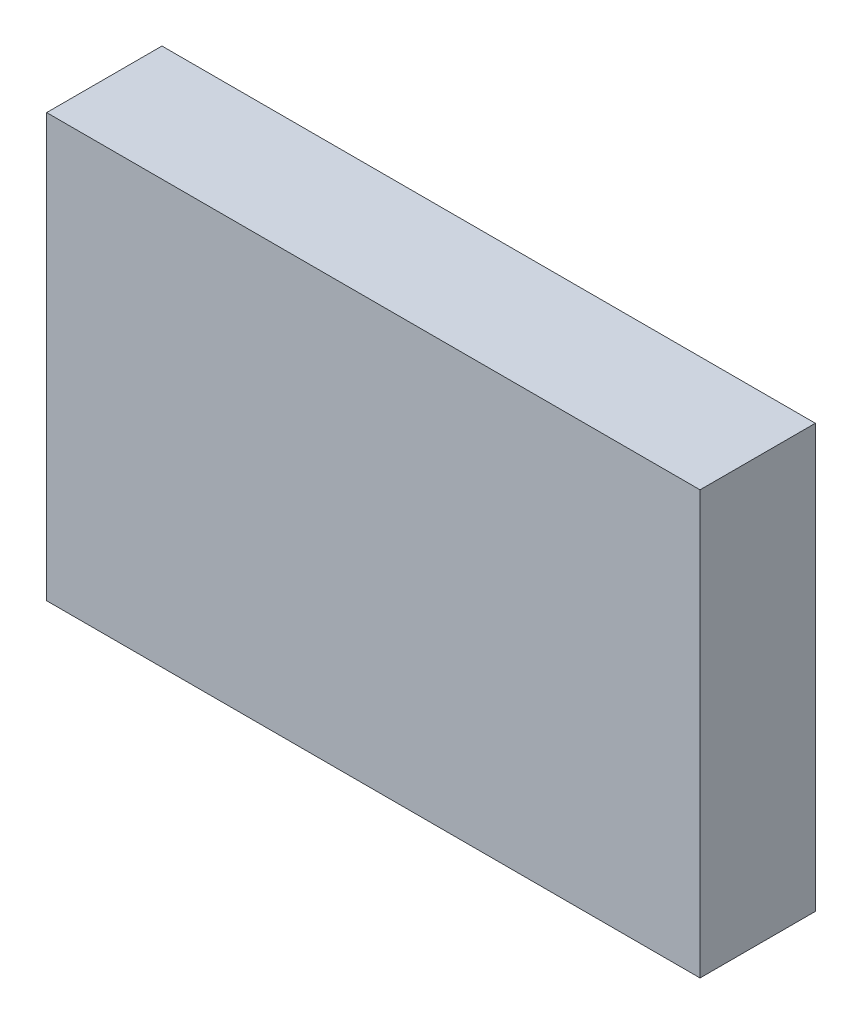
ISO-10303-21;
HEADER;
FILE_DESCRIPTION(('STEP AP214'),'2;1');
FILE_NAME('part.step','',(''),(''),'','','');
FILE_SCHEMA(('AUTOMOTIVE_DESIGN { 1 0 10303 214 1 1 1 1 }'));
ENDSEC;
DATA;
#1=APPLICATION_CONTEXT('core data for automotive mechanical design processes');
#2=APPLICATION_PROTOCOL_DEFINITION('international standard','automotive_design',2000,#1);
#3=PRODUCT_CONTEXT('',#1,'mechanical');
#4=PRODUCT('Part','Part','',(#3));
#5=PRODUCT_RELATED_PRODUCT_CATEGORY('part','',(#4));
#6=PRODUCT_DEFINITION_FORMATION('','',#4);
#7=PRODUCT_DEFINITION_CONTEXT('part definition',#1,'design');
#8=PRODUCT_DEFINITION('design','',#6,#7);
#9=PRODUCT_DEFINITION_SHAPE('','',#8);
#10=(LENGTH_UNIT() NAMED_UNIT(*) SI_UNIT(.MILLI.,.METRE.));
#11=(NAMED_UNIT(*) PLANE_ANGLE_UNIT() SI_UNIT($,.RADIAN.));
#12=(NAMED_UNIT(*) SI_UNIT($,.STERADIAN.) SOLID_ANGLE_UNIT());
#13=UNCERTAINTY_MEASURE_WITH_UNIT(LENGTH_MEASURE(1.E-05),#10,'distance_accuracy_value','');
#14=(GEOMETRIC_REPRESENTATION_CONTEXT(3) GLOBAL_UNCERTAINTY_ASSIGNED_CONTEXT((#13)) GLOBAL_UNIT_ASSIGNED_CONTEXT((#10,
#11,#12)) REPRESENTATION_CONTEXT('',''));
#15=CARTESIAN_POINT('',(0.,0.,0.));
#16=DIRECTION('',(0.,0.,1.));
#17=DIRECTION('',(1.,0.,0.));
#18=AXIS2_PLACEMENT_3D('',#15,#16,#17);
#19=CARTESIAN_POINT('',(-42.5,-27.5,15.));
#20=DIRECTION('',(0.,1.,0.));
#21=DIRECTION('',(0.,0.,1.));
#22=AXIS2_PLACEMENT_3D('',#19,#20,#21);
#23=PLANE('',#22);
#24=DIRECTION('',(1.,0.,0.));
#25=VECTOR('',#24,1.);
#26=CARTESIAN_POINT('',(-42.5,-27.5,0.));
#27=LINE('',#26,#25);
#28=CARTESIAN_POINT('',(-42.5,-27.5,0.));
#29=VERTEX_POINT('',#28);
#30=CARTESIAN_POINT('',(42.5,-27.5,0.));
#31=VERTEX_POINT('',#30);
#32=EDGE_CURVE('E107',#29,#31,#27,.T.);
#33=ORIENTED_EDGE('',*,*,#32,.T.);
#34=DIRECTION('',(0.,0.,-1.));
#35=VECTOR('',#34,1.);
#36=CARTESIAN_POINT('',(42.5,-27.5,15.));
#37=LINE('',#36,#35);
#38=CARTESIAN_POINT('',(42.5,-27.5,15.));
#39=VERTEX_POINT('',#38);
#40=EDGE_CURVE('E11',#39,#31,#37,.T.);
#41=ORIENTED_EDGE('',*,*,#40,.F.);
#42=DIRECTION('',(1.,0.,0.));
#43=VECTOR('',#42,1.);
#44=CARTESIAN_POINT('',(-42.5,-27.5,15.));
#45=LINE('',#44,#43);
#46=CARTESIAN_POINT('',(-42.5,-27.5,15.));
#47=VERTEX_POINT('',#46);
#48=EDGE_CURVE('E89',#47,#39,#45,.T.);
#49=ORIENTED_EDGE('',*,*,#48,.F.);
#50=DIRECTION('',(0.,0.,-1.));
#51=VECTOR('',#50,1.);
#52=CARTESIAN_POINT('',(-42.5,-27.5,15.));
#53=LINE('',#52,#51);
#54=EDGE_CURVE('E56',#47,#29,#53,.T.);
#55=ORIENTED_EDGE('',*,*,#54,.T.);
#56=EDGE_LOOP('',(#33,#41,#49,#55));
#57=FACE_BOUND('',#56,.T.);
#58=ADVANCED_FACE('F39',(#57),#23,.F.);
#59=CARTESIAN_POINT('',(42.5,-27.5,15.));
#60=DIRECTION('',(-1.,0.,0.));
#61=DIRECTION('',(0.,0.,1.));
#62=AXIS2_PLACEMENT_3D('',#59,#60,#61);
#63=PLANE('',#62);
#64=DIRECTION('',(0.,1.,0.));
#65=VECTOR('',#64,1.);
#66=CARTESIAN_POINT('',(42.5,-27.5,0.));
#67=LINE('',#66,#65);
#68=CARTESIAN_POINT('',(42.5,27.5,0.));
#69=VERTEX_POINT('',#68);
#70=EDGE_CURVE('E95',#31,#69,#67,.T.);
#71=ORIENTED_EDGE('',*,*,#70,.T.);
#72=DIRECTION('',(0.,0.,-1.));
#73=VECTOR('',#72,1.);
#74=CARTESIAN_POINT('',(42.5,27.5,15.));
#75=LINE('',#74,#73);
#76=CARTESIAN_POINT('',(42.5,27.5,15.));
#77=VERTEX_POINT('',#76);
#78=EDGE_CURVE('E48',#77,#69,#75,.T.);
#79=ORIENTED_EDGE('',*,*,#78,.F.);
#80=DIRECTION('',(0.,1.,0.));
#81=VECTOR('',#80,1.);
#82=CARTESIAN_POINT('',(42.5,-27.5,15.));
#83=LINE('',#82,#81);
#84=EDGE_CURVE('E81',#39,#77,#83,.T.);
#85=ORIENTED_EDGE('',*,*,#84,.F.);
#86=ORIENTED_EDGE('',*,*,#40,.T.);
#87=EDGE_LOOP('',(#71,#79,#85,#86));
#88=FACE_BOUND('',#87,.T.);
#89=ADVANCED_FACE('F94',(#88),#63,.F.);
#90=CARTESIAN_POINT('',(-42.5,27.5,15.));
#91=DIRECTION('',(0.,1.,0.));
#92=DIRECTION('',(0.,0.,1.));
#93=AXIS2_PLACEMENT_3D('',#90,#91,#92);
#94=PLANE('',#93);
#95=DIRECTION('',(1.,0.,0.));
#96=VECTOR('',#95,1.);
#97=CARTESIAN_POINT('',(-42.5,27.5,0.));
#98=LINE('',#97,#96);
#99=CARTESIAN_POINT('',(-42.5,27.5,0.));
#100=VERTEX_POINT('',#99);
#101=EDGE_CURVE('E112',#100,#69,#98,.T.);
#102=ORIENTED_EDGE('',*,*,#101,.F.);
#103=DIRECTION('',(0.,0.,-1.));
#104=VECTOR('',#103,1.);
#105=CARTESIAN_POINT('',(-42.5,27.5,15.));
#106=LINE('',#105,#104);
#107=CARTESIAN_POINT('',(-42.5,27.5,15.));
#108=VERTEX_POINT('',#107);
#109=EDGE_CURVE('E70',#108,#100,#106,.T.);
#110=ORIENTED_EDGE('',*,*,#109,.F.);
#111=DIRECTION('',(1.,0.,0.));
#112=VECTOR('',#111,1.);
#113=CARTESIAN_POINT('',(-42.5,27.5,15.));
#114=LINE('',#113,#112);
#115=EDGE_CURVE('E88',#108,#77,#114,.T.);
#116=ORIENTED_EDGE('',*,*,#115,.T.);
#117=ORIENTED_EDGE('',*,*,#78,.T.);
#118=EDGE_LOOP('',(#102,#110,#116,#117));
#119=FACE_BOUND('',#118,.T.);
#120=ADVANCED_FACE('F99',(#119),#94,.T.);
#121=CARTESIAN_POINT('',(-42.5,-27.5,15.));
#122=DIRECTION('',(-1.,0.,0.));
#123=DIRECTION('',(0.,0.,1.));
#124=AXIS2_PLACEMENT_3D('',#121,#122,#123);
#125=PLANE('',#124);
#126=DIRECTION('',(0.,1.,0.));
#127=VECTOR('',#126,1.);
#128=CARTESIAN_POINT('',(-42.5,-27.5,0.));
#129=LINE('',#128,#127);
#130=EDGE_CURVE('E115',#29,#100,#129,.T.);
#131=ORIENTED_EDGE('',*,*,#130,.F.);
#132=ORIENTED_EDGE('',*,*,#54,.F.);
#133=DIRECTION('',(0.,1.,0.));
#134=VECTOR('',#133,1.);
#135=CARTESIAN_POINT('',(-42.5,-27.5,15.));
#136=LINE('',#135,#134);
#137=EDGE_CURVE('E101',#47,#108,#136,.T.);
#138=ORIENTED_EDGE('',*,*,#137,.T.);
#139=ORIENTED_EDGE('',*,*,#109,.T.);
#140=EDGE_LOOP('',(#131,#132,#138,#139));
#141=FACE_BOUND('',#140,.T.);
#142=ADVANCED_FACE('F125',(#141),#125,.T.);
#143=CARTESIAN_POINT('',(0.,0.,15.));
#144=DIRECTION('',(0.,0.,1.));
#145=DIRECTION('',(1.,0.,0.));
#146=AXIS2_PLACEMENT_3D('',#143,#144,#145);
#147=PLANE('',#146);
#148=ORIENTED_EDGE('',*,*,#48,.T.);
#149=ORIENTED_EDGE('',*,*,#84,.T.);
#150=ORIENTED_EDGE('',*,*,#115,.F.);
#151=ORIENTED_EDGE('',*,*,#137,.F.);
#152=EDGE_LOOP('',(#148,#149,#150,#151));
#153=FACE_BOUND('',#152,.T.);
#154=ADVANCED_FACE('F85',(#153),#147,.T.);
#155=CARTESIAN_POINT('',(0.,0.,0.));
#156=DIRECTION('',(0.,0.,1.));
#157=DIRECTION('',(1.,0.,0.));
#158=AXIS2_PLACEMENT_3D('',#155,#156,#157);
#159=PLANE('',#158);
#160=ORIENTED_EDGE('',*,*,#32,.F.);
#161=ORIENTED_EDGE('',*,*,#130,.T.);
#162=ORIENTED_EDGE('',*,*,#101,.T.);
#163=ORIENTED_EDGE('',*,*,#70,.F.);
#164=EDGE_LOOP('',(#160,#161,#162,#163));
#165=FACE_BOUND('',#164,.T.);
#166=ADVANCED_FACE('F124',(#165),#159,.F.);
#167=CLOSED_SHELL('',(#58,#89,#120,#142,#154,#166));
#168=MANIFOLD_SOLID_BREP('B2',#167);
#169=ADVANCED_BREP_SHAPE_REPRESENTATION('',(#18,#168),#14);
#170=SHAPE_DEFINITION_REPRESENTATION(#9,#169);
ENDSEC;
END-ISO-10303-21;
